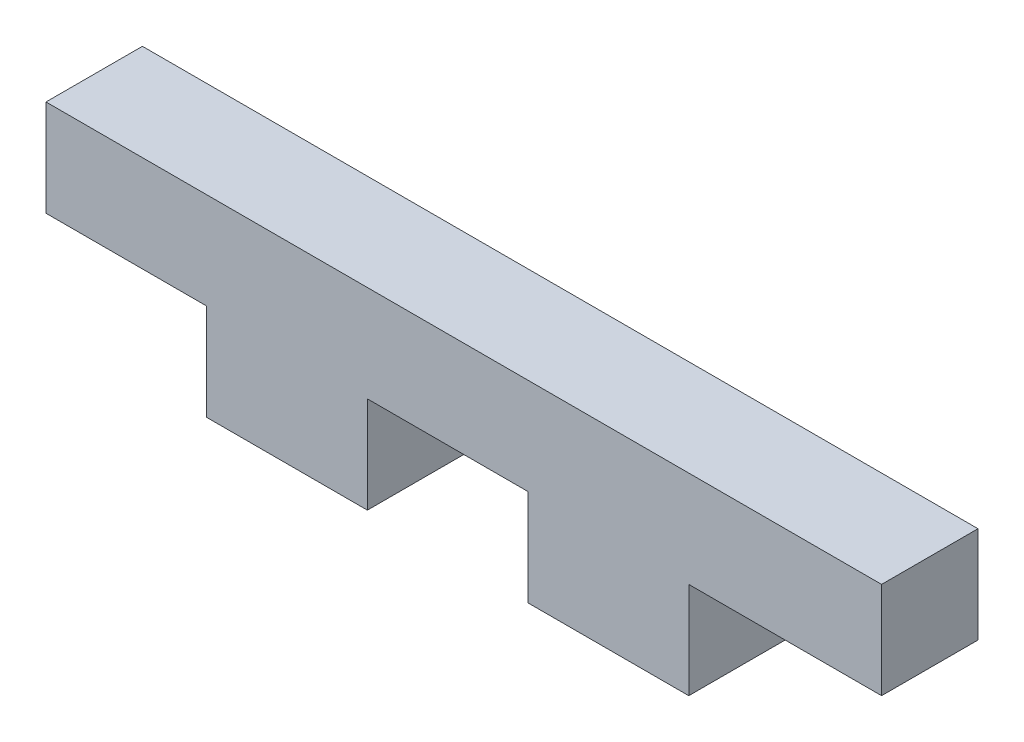
ISO-10303-21;
HEADER;
FILE_DESCRIPTION(('STEP AP214'),'2;1');
FILE_NAME('part.step','',(''),(''),'','','');
FILE_SCHEMA(('AUTOMOTIVE_DESIGN { 1 0 10303 214 1 1 1 1 }'));
ENDSEC;
DATA;
#1=APPLICATION_CONTEXT('core data for automotive mechanical design processes');
#2=APPLICATION_PROTOCOL_DEFINITION('international standard','automotive_design',2000,#1);
#3=PRODUCT_CONTEXT('',#1,'mechanical');
#4=PRODUCT('Part','Part','',(#3));
#5=PRODUCT_RELATED_PRODUCT_CATEGORY('part','',(#4));
#6=PRODUCT_DEFINITION_FORMATION('','',#4);
#7=PRODUCT_DEFINITION_CONTEXT('part definition',#1,'design');
#8=PRODUCT_DEFINITION('design','',#6,#7);
#9=PRODUCT_DEFINITION_SHAPE('','',#8);
#10=(LENGTH_UNIT() NAMED_UNIT(*) SI_UNIT(.MILLI.,.METRE.));
#11=(NAMED_UNIT(*) PLANE_ANGLE_UNIT() SI_UNIT($,.RADIAN.));
#12=(NAMED_UNIT(*) SI_UNIT($,.STERADIAN.) SOLID_ANGLE_UNIT());
#13=UNCERTAINTY_MEASURE_WITH_UNIT(LENGTH_MEASURE(1.E-05),#10,'distance_accuracy_value','');
#14=(GEOMETRIC_REPRESENTATION_CONTEXT(3) GLOBAL_UNCERTAINTY_ASSIGNED_CONTEXT((#13)) GLOBAL_UNIT_ASSIGNED_CONTEXT((#10,
#11,#12)) REPRESENTATION_CONTEXT('',''));
#15=CARTESIAN_POINT('',(0.,0.,0.));
#16=DIRECTION('',(0.,0.,1.));
#17=DIRECTION('',(1.,0.,0.));
#18=AXIS2_PLACEMENT_3D('',#15,#16,#17);
#19=CARTESIAN_POINT('',(8.99010664219347,0.,3.));
#20=DIRECTION('',(1.,0.,0.));
#21=DIRECTION('',(0.,1.,0.));
#22=AXIS2_PLACEMENT_3D('',#19,#20,#21);
#23=PLANE('',#22);
#24=DIRECTION('',(0.,-1.,0.));
#25=VECTOR('',#24,1.);
#26=CARTESIAN_POINT('',(8.99010664219347,0.,0.));
#27=LINE('',#26,#25);
#28=CARTESIAN_POINT('',(8.99010664219347,0.100430327009231,0.));
#29=VERTEX_POINT('',#28);
#30=CARTESIAN_POINT('',(8.99010664219347,-2.89956967299077,0.));
#31=VERTEX_POINT('',#30);
#32=EDGE_CURVE('E203',#29,#31,#27,.T.);
#33=ORIENTED_EDGE('',*,*,#32,.F.);
#34=DIRECTION('',(0.,0.,-1.));
#35=VECTOR('',#34,1.);
#36=CARTESIAN_POINT('',(8.99010664219347,0.100430327009231,3.));
#37=LINE('',#36,#35);
#38=CARTESIAN_POINT('',(8.99010664219347,0.100430327009231,3.));
#39=VERTEX_POINT('',#38);
#40=EDGE_CURVE('E11',#39,#29,#37,.T.);
#41=ORIENTED_EDGE('',*,*,#40,.F.);
#42=DIRECTION('',(0.,-1.,0.));
#43=VECTOR('',#42,1.);
#44=CARTESIAN_POINT('',(8.99010664219347,0.,3.));
#45=LINE('',#44,#43);
#46=CARTESIAN_POINT('',(8.99010664219347,-2.89956967299077,3.));
#47=VERTEX_POINT('',#46);
#48=EDGE_CURVE('E158',#39,#47,#45,.T.);
#49=ORIENTED_EDGE('',*,*,#48,.T.);
#50=DIRECTION('',(0.,0.,-1.));
#51=VECTOR('',#50,1.);
#52=CARTESIAN_POINT('',(8.99010664219347,-2.89956967299077,3.));
#53=LINE('',#52,#51);
#54=EDGE_CURVE('E97',#47,#31,#53,.T.);
#55=ORIENTED_EDGE('',*,*,#54,.T.);
#56=EDGE_LOOP('',(#33,#41,#49,#55));
#57=FACE_BOUND('',#56,.T.);
#58=ADVANCED_FACE('F35',(#57),#23,.T.);
#59=CARTESIAN_POINT('',(0.,0.10043032700923,3.));
#60=DIRECTION('',(0.,-1.,0.));
#61=DIRECTION('',(1.,0.,0.));
#62=AXIS2_PLACEMENT_3D('',#59,#60,#61);
#63=PLANE('',#62);
#64=DIRECTION('',(-1.,0.,0.));
#65=VECTOR('',#64,1.);
#66=CARTESIAN_POINT('',(0.,0.10043032700923,0.));
#67=LINE('',#66,#65);
#68=CARTESIAN_POINT('',(13.9901066421935,0.100430327009232,0.));
#69=VERTEX_POINT('',#68);
#70=EDGE_CURVE('E197',#69,#29,#67,.T.);
#71=ORIENTED_EDGE('',*,*,#70,.F.);
#72=DIRECTION('',(0.,0.,-1.));
#73=VECTOR('',#72,1.);
#74=CARTESIAN_POINT('',(13.9901066421935,0.100430327009232,3.));
#75=LINE('',#74,#73);
#76=CARTESIAN_POINT('',(13.9901066421935,0.100430327009232,3.));
#77=VERTEX_POINT('',#76);
#78=EDGE_CURVE('E43',#77,#69,#75,.T.);
#79=ORIENTED_EDGE('',*,*,#78,.F.);
#80=DIRECTION('',(-1.,0.,0.));
#81=VECTOR('',#80,1.);
#82=CARTESIAN_POINT('',(0.,0.10043032700923,3.));
#83=LINE('',#82,#81);
#84=EDGE_CURVE('E148',#77,#39,#83,.T.);
#85=ORIENTED_EDGE('',*,*,#84,.T.);
#86=ORIENTED_EDGE('',*,*,#40,.T.);
#87=EDGE_LOOP('',(#71,#79,#85,#86));
#88=FACE_BOUND('',#87,.T.);
#89=ADVANCED_FACE('F202',(#88),#63,.T.);
#90=CARTESIAN_POINT('',(13.9901066421935,0.,3.));
#91=DIRECTION('',(1.,0.,0.));
#92=DIRECTION('',(0.,0.,-1.));
#93=AXIS2_PLACEMENT_3D('',#90,#91,#92);
#94=PLANE('',#93);
#95=DIRECTION('',(0.,-1.,0.));
#96=VECTOR('',#95,1.);
#97=CARTESIAN_POINT('',(13.9901066421935,0.,0.));
#98=LINE('',#97,#96);
#99=CARTESIAN_POINT('',(13.9901066421935,-2.89956967299077,0.));
#100=VERTEX_POINT('',#99);
#101=EDGE_CURVE('E191',#69,#100,#98,.T.);
#102=ORIENTED_EDGE('',*,*,#101,.T.);
#103=DIRECTION('',(0.,0.,-1.));
#104=VECTOR('',#103,1.);
#105=CARTESIAN_POINT('',(13.9901066421935,-2.89956967299077,3.));
#106=LINE('',#105,#104);
#107=CARTESIAN_POINT('',(13.9901066421935,-2.89956967299077,3.));
#108=VERTEX_POINT('',#107);
#109=EDGE_CURVE('E184',#108,#100,#106,.T.);
#110=ORIENTED_EDGE('',*,*,#109,.F.);
#111=DIRECTION('',(0.,-1.,0.));
#112=VECTOR('',#111,1.);
#113=CARTESIAN_POINT('',(13.9901066421935,0.,3.));
#114=LINE('',#113,#112);
#115=EDGE_CURVE('E157',#77,#108,#114,.T.);
#116=ORIENTED_EDGE('',*,*,#115,.F.);
#117=ORIENTED_EDGE('',*,*,#78,.T.);
#118=EDGE_LOOP('',(#102,#110,#116,#117));
#119=FACE_BOUND('',#118,.T.);
#120=ADVANCED_FACE('F189',(#119),#94,.F.);
#121=CARTESIAN_POINT('',(0.,-2.89956967299077,3.));
#122=DIRECTION('',(0.,1.,0.));
#123=DIRECTION('',(0.,0.,1.));
#124=AXIS2_PLACEMENT_3D('',#121,#122,#123);
#125=PLANE('',#124);
#126=DIRECTION('',(1.,0.,0.));
#127=VECTOR('',#126,1.);
#128=CARTESIAN_POINT('',(0.,-2.89956967299077,0.));
#129=LINE('',#128,#127);
#130=CARTESIAN_POINT('',(18.9901066421935,-2.89956967299077,0.));
#131=VERTEX_POINT('',#130);
#132=EDGE_CURVE('E200',#100,#131,#129,.T.);
#133=ORIENTED_EDGE('',*,*,#132,.T.);
#134=DIRECTION('',(0.,0.,-1.));
#135=VECTOR('',#134,1.);
#136=CARTESIAN_POINT('',(18.9901066421935,-2.89956967299077,3.));
#137=LINE('',#136,#135);
#138=CARTESIAN_POINT('',(18.9901066421935,-2.89956967299077,3.));
#139=VERTEX_POINT('',#138);
#140=EDGE_CURVE('E182',#139,#131,#137,.T.);
#141=ORIENTED_EDGE('',*,*,#140,.F.);
#142=DIRECTION('',(1.,0.,0.));
#143=VECTOR('',#142,1.);
#144=CARTESIAN_POINT('',(0.,-2.89956967299077,3.));
#145=LINE('',#144,#143);
#146=EDGE_CURVE('E161',#108,#139,#145,.T.);
#147=ORIENTED_EDGE('',*,*,#146,.F.);
#148=ORIENTED_EDGE('',*,*,#109,.T.);
#149=EDGE_LOOP('',(#133,#141,#147,#148));
#150=FACE_BOUND('',#149,.T.);
#151=ADVANCED_FACE('F234',(#150),#125,.F.);
#152=CARTESIAN_POINT('',(18.9901066421935,0.,3.));
#153=DIRECTION('',(1.,0.,0.));
#154=DIRECTION('',(0.,0.,-1.));
#155=AXIS2_PLACEMENT_3D('',#152,#153,#154);
#156=PLANE('',#155);
#157=DIRECTION('',(0.,-1.,0.));
#158=VECTOR('',#157,1.);
#159=CARTESIAN_POINT('',(18.9901066421935,0.,0.));
#160=LINE('',#159,#158);
#161=CARTESIAN_POINT('',(18.9901066421935,0.100430327009233,0.));
#162=VERTEX_POINT('',#161);
#163=EDGE_CURVE('E210',#162,#131,#160,.T.);
#164=ORIENTED_EDGE('',*,*,#163,.F.);
#165=DIRECTION('',(0.,0.,-1.));
#166=VECTOR('',#165,1.);
#167=CARTESIAN_POINT('',(18.9901066421935,0.100430327009233,3.));
#168=LINE('',#167,#166);
#169=CARTESIAN_POINT('',(18.9901066421935,0.100430327009233,3.));
#170=VERTEX_POINT('',#169);
#171=EDGE_CURVE('E180',#170,#162,#168,.T.);
#172=ORIENTED_EDGE('',*,*,#171,.F.);
#173=DIRECTION('',(0.,-1.,0.));
#174=VECTOR('',#173,1.);
#175=CARTESIAN_POINT('',(18.9901066421935,0.,3.));
#176=LINE('',#175,#174);
#177=EDGE_CURVE('E155',#170,#139,#176,.T.);
#178=ORIENTED_EDGE('',*,*,#177,.T.);
#179=ORIENTED_EDGE('',*,*,#140,.T.);
#180=EDGE_LOOP('',(#164,#172,#178,#179));
#181=FACE_BOUND('',#180,.T.);
#182=ADVANCED_FACE('F239',(#181),#156,.T.);
#183=CARTESIAN_POINT('',(24.9901066421935,0.100430327009233,0.));
#184=VERTEX_POINT('',#183);
#185=EDGE_CURVE('E205',#184,#162,#67,.T.);
#186=ORIENTED_EDGE('',*,*,#185,.F.);
#187=DIRECTION('',(0.,0.,-1.));
#188=VECTOR('',#187,1.);
#189=CARTESIAN_POINT('',(24.9901066421935,0.100430327009233,3.));
#190=LINE('',#189,#188);
#191=CARTESIAN_POINT('',(24.9901066421935,0.100430327009233,3.));
#192=VERTEX_POINT('',#191);
#193=EDGE_CURVE('E178',#192,#184,#190,.T.);
#194=ORIENTED_EDGE('',*,*,#193,.F.);
#195=EDGE_CURVE('E147',#192,#170,#83,.T.);
#196=ORIENTED_EDGE('',*,*,#195,.T.);
#197=ORIENTED_EDGE('',*,*,#171,.T.);
#198=EDGE_LOOP('',(#186,#194,#196,#197));
#199=FACE_BOUND('',#198,.T.);
#200=ADVANCED_FACE('F230',(#199),#63,.T.);
#201=CARTESIAN_POINT('',(24.9901066421935,0.,3.));
#202=DIRECTION('',(1.,0.,0.));
#203=DIRECTION('',(0.,0.,-1.));
#204=AXIS2_PLACEMENT_3D('',#201,#202,#203);
#205=PLANE('',#204);
#206=DIRECTION('',(0.,-1.,0.));
#207=VECTOR('',#206,1.);
#208=CARTESIAN_POINT('',(24.9901066421935,0.,0.));
#209=LINE('',#208,#207);
#210=CARTESIAN_POINT('',(24.9901066421935,3.10043032700923,0.));
#211=VERTEX_POINT('',#210);
#212=EDGE_CURVE('E209',#211,#184,#209,.T.);
#213=ORIENTED_EDGE('',*,*,#212,.F.);
#214=DIRECTION('',(0.,0.,-1.));
#215=VECTOR('',#214,1.);
#216=CARTESIAN_POINT('',(24.9901066421935,3.10043032700923,3.));
#217=LINE('',#216,#215);
#218=CARTESIAN_POINT('',(24.9901066421935,3.10043032700923,3.));
#219=VERTEX_POINT('',#218);
#220=EDGE_CURVE('E176',#219,#211,#217,.T.);
#221=ORIENTED_EDGE('',*,*,#220,.F.);
#222=DIRECTION('',(0.,-1.,0.));
#223=VECTOR('',#222,1.);
#224=CARTESIAN_POINT('',(24.9901066421935,0.,3.));
#225=LINE('',#224,#223);
#226=EDGE_CURVE('E154',#219,#192,#225,.T.);
#227=ORIENTED_EDGE('',*,*,#226,.T.);
#228=ORIENTED_EDGE('',*,*,#193,.T.);
#229=EDGE_LOOP('',(#213,#221,#227,#228));
#230=FACE_BOUND('',#229,.T.);
#231=ADVANCED_FACE('F238',(#230),#205,.T.);
#232=CARTESIAN_POINT('',(0.,3.10043032700923,3.));
#233=DIRECTION('',(0.,-1.,0.));
#234=DIRECTION('',(1.,0.,0.));
#235=AXIS2_PLACEMENT_3D('',#232,#233,#234);
#236=PLANE('',#235);
#237=DIRECTION('',(-1.,0.,0.));
#238=VECTOR('',#237,1.);
#239=CARTESIAN_POINT('',(0.,3.10043032700923,0.));
#240=LINE('',#239,#238);
#241=CARTESIAN_POINT('',(-1.00989335780653,3.10043032700923,0.));
#242=VERTEX_POINT('',#241);
#243=EDGE_CURVE('E213',#211,#242,#240,.T.);
#244=ORIENTED_EDGE('',*,*,#243,.T.);
#245=DIRECTION('',(0.,0.,-1.));
#246=VECTOR('',#245,1.);
#247=CARTESIAN_POINT('',(-1.00989335780653,3.10043032700923,3.));
#248=LINE('',#247,#246);
#249=CARTESIAN_POINT('',(-1.00989335780653,3.10043032700923,3.));
#250=VERTEX_POINT('',#249);
#251=EDGE_CURVE('E173',#250,#242,#248,.T.);
#252=ORIENTED_EDGE('',*,*,#251,.F.);
#253=DIRECTION('',(-1.,0.,0.));
#254=VECTOR('',#253,1.);
#255=CARTESIAN_POINT('',(0.,3.10043032700923,3.));
#256=LINE('',#255,#254);
#257=EDGE_CURVE('E149',#219,#250,#256,.T.);
#258=ORIENTED_EDGE('',*,*,#257,.F.);
#259=ORIENTED_EDGE('',*,*,#220,.T.);
#260=EDGE_LOOP('',(#244,#252,#258,#259));
#261=FACE_BOUND('',#260,.T.);
#262=ADVANCED_FACE('F247',(#261),#236,.F.);
#263=CARTESIAN_POINT('',(-1.00989335780653,0.,3.));
#264=DIRECTION('',(1.,0.,0.));
#265=DIRECTION('',(0.,1.,0.));
#266=AXIS2_PLACEMENT_3D('',#263,#264,#265);
#267=PLANE('',#266);
#268=DIRECTION('',(0.,-1.,0.));
#269=VECTOR('',#268,1.);
#270=CARTESIAN_POINT('',(-1.00989335780653,0.,0.));
#271=LINE('',#270,#269);
#272=CARTESIAN_POINT('',(-1.00989335780653,0.10043032700923,0.));
#273=VERTEX_POINT('',#272);
#274=EDGE_CURVE('E207',#242,#273,#271,.T.);
#275=ORIENTED_EDGE('',*,*,#274,.T.);
#276=DIRECTION('',(0.,0.,-1.));
#277=VECTOR('',#276,1.);
#278=CARTESIAN_POINT('',(-1.00989335780653,0.10043032700923,3.));
#279=LINE('',#278,#277);
#280=CARTESIAN_POINT('',(-1.00989335780653,0.10043032700923,3.));
#281=VERTEX_POINT('',#280);
#282=EDGE_CURVE('E136',#281,#273,#279,.T.);
#283=ORIENTED_EDGE('',*,*,#282,.F.);
#284=DIRECTION('',(0.,-1.,0.));
#285=VECTOR('',#284,1.);
#286=CARTESIAN_POINT('',(-1.00989335780653,0.,3.));
#287=LINE('',#286,#285);
#288=EDGE_CURVE('E144',#250,#281,#287,.T.);
#289=ORIENTED_EDGE('',*,*,#288,.F.);
#290=ORIENTED_EDGE('',*,*,#251,.T.);
#291=EDGE_LOOP('',(#275,#283,#289,#290));
#292=FACE_BOUND('',#291,.T.);
#293=ADVANCED_FACE('F222',(#292),#267,.F.);
#294=CARTESIAN_POINT('',(3.99010664219347,0.100430327009231,0.));
#295=VERTEX_POINT('',#294);
#296=EDGE_CURVE('E135',#295,#273,#67,.T.);
#297=ORIENTED_EDGE('',*,*,#296,.F.);
#298=DIRECTION('',(0.,0.,-1.));
#299=VECTOR('',#298,1.);
#300=CARTESIAN_POINT('',(3.99010664219347,0.100430327009231,3.));
#301=LINE('',#300,#299);
#302=CARTESIAN_POINT('',(3.99010664219347,0.100430327009231,3.));
#303=VERTEX_POINT('',#302);
#304=EDGE_CURVE('E129',#303,#295,#301,.T.);
#305=ORIENTED_EDGE('',*,*,#304,.F.);
#306=EDGE_CURVE('E133',#303,#281,#83,.T.);
#307=ORIENTED_EDGE('',*,*,#306,.T.);
#308=ORIENTED_EDGE('',*,*,#282,.T.);
#309=EDGE_LOOP('',(#297,#305,#307,#308));
#310=FACE_BOUND('',#309,.T.);
#311=ADVANCED_FACE('F131',(#310),#63,.T.);
#312=CARTESIAN_POINT('',(3.99010664219347,0.,3.));
#313=DIRECTION('',(1.,0.,0.));
#314=DIRECTION('',(0.,1.,0.));
#315=AXIS2_PLACEMENT_3D('',#312,#313,#314);
#316=PLANE('',#315);
#317=DIRECTION('',(0.,-1.,0.));
#318=VECTOR('',#317,1.);
#319=CARTESIAN_POINT('',(3.99010664219347,0.,0.));
#320=LINE('',#319,#318);
#321=CARTESIAN_POINT('',(3.99010664219347,-2.89956967299077,0.));
#322=VERTEX_POINT('',#321);
#323=EDGE_CURVE('E90',#295,#322,#320,.T.);
#324=ORIENTED_EDGE('',*,*,#323,.T.);
#325=DIRECTION('',(0.,0.,-1.));
#326=VECTOR('',#325,1.);
#327=CARTESIAN_POINT('',(3.99010664219347,-2.89956967299077,3.));
#328=LINE('',#327,#326);
#329=CARTESIAN_POINT('',(3.99010664219347,-2.89956967299077,3.));
#330=VERTEX_POINT('',#329);
#331=EDGE_CURVE('E137',#330,#322,#328,.T.);
#332=ORIENTED_EDGE('',*,*,#331,.F.);
#333=DIRECTION('',(0.,-1.,0.));
#334=VECTOR('',#333,1.);
#335=CARTESIAN_POINT('',(3.99010664219347,0.,3.));
#336=LINE('',#335,#334);
#337=EDGE_CURVE('E139',#303,#330,#336,.T.);
#338=ORIENTED_EDGE('',*,*,#337,.F.);
#339=ORIENTED_EDGE('',*,*,#304,.T.);
#340=EDGE_LOOP('',(#324,#332,#338,#339));
#341=FACE_BOUND('',#340,.T.);
#342=ADVANCED_FACE('F140',(#341),#316,.F.);
#343=CARTESIAN_POINT('',(0.,-2.89956967299077,3.));
#344=DIRECTION('',(0.,1.,0.));
#345=DIRECTION('',(-1.,0.,0.));
#346=AXIS2_PLACEMENT_3D('',#343,#344,#345);
#347=PLANE('',#346);
#348=DIRECTION('',(1.,0.,0.));
#349=VECTOR('',#348,1.);
#350=CARTESIAN_POINT('',(0.,-2.89956967299077,0.));
#351=LINE('',#350,#349);
#352=EDGE_CURVE('E162',#322,#31,#351,.T.);
#353=ORIENTED_EDGE('',*,*,#352,.T.);
#354=ORIENTED_EDGE('',*,*,#54,.F.);
#355=DIRECTION('',(1.,0.,0.));
#356=VECTOR('',#355,1.);
#357=CARTESIAN_POINT('',(0.,-2.89956967299077,3.));
#358=LINE('',#357,#356);
#359=EDGE_CURVE('E51',#330,#47,#358,.T.);
#360=ORIENTED_EDGE('',*,*,#359,.F.);
#361=ORIENTED_EDGE('',*,*,#331,.T.);
#362=EDGE_LOOP('',(#353,#354,#360,#361));
#363=FACE_BOUND('',#362,.T.);
#364=ADVANCED_FACE('F246',(#363),#347,.F.);
#365=CARTESIAN_POINT('',(0.,0.,3.));
#366=DIRECTION('',(0.,0.,1.));
#367=DIRECTION('',(1.,0.,0.));
#368=AXIS2_PLACEMENT_3D('',#365,#366,#367);
#369=PLANE('',#368);
#370=ORIENTED_EDGE('',*,*,#48,.F.);
#371=ORIENTED_EDGE('',*,*,#84,.F.);
#372=ORIENTED_EDGE('',*,*,#115,.T.);
#373=ORIENTED_EDGE('',*,*,#146,.T.);
#374=ORIENTED_EDGE('',*,*,#177,.F.);
#375=ORIENTED_EDGE('',*,*,#195,.F.);
#376=ORIENTED_EDGE('',*,*,#226,.F.);
#377=ORIENTED_EDGE('',*,*,#257,.T.);
#378=ORIENTED_EDGE('',*,*,#288,.T.);
#379=ORIENTED_EDGE('',*,*,#306,.F.);
#380=ORIENTED_EDGE('',*,*,#337,.T.);
#381=ORIENTED_EDGE('',*,*,#359,.T.);
#382=EDGE_LOOP('',(#370,#371,#372,#373,#374,#375,#376,#377,#378,#379,#380,#381));
#383=FACE_BOUND('',#382,.T.);
#384=ADVANCED_FACE('F142',(#383),#369,.T.);
#385=CARTESIAN_POINT('',(0.,0.,0.));
#386=DIRECTION('',(0.,0.,1.));
#387=DIRECTION('',(1.,0.,0.));
#388=AXIS2_PLACEMENT_3D('',#385,#386,#387);
#389=PLANE('',#388);
#390=ORIENTED_EDGE('',*,*,#32,.T.);
#391=ORIENTED_EDGE('',*,*,#352,.F.);
#392=ORIENTED_EDGE('',*,*,#323,.F.);
#393=ORIENTED_EDGE('',*,*,#296,.T.);
#394=ORIENTED_EDGE('',*,*,#274,.F.);
#395=ORIENTED_EDGE('',*,*,#243,.F.);
#396=ORIENTED_EDGE('',*,*,#212,.T.);
#397=ORIENTED_EDGE('',*,*,#185,.T.);
#398=ORIENTED_EDGE('',*,*,#163,.T.);
#399=ORIENTED_EDGE('',*,*,#132,.F.);
#400=ORIENTED_EDGE('',*,*,#101,.F.);
#401=ORIENTED_EDGE('',*,*,#70,.T.);
#402=EDGE_LOOP('',(#390,#391,#392,#393,#394,#395,#396,#397,#398,#399,#400,#401));
#403=FACE_BOUND('',#402,.T.);
#404=ADVANCED_FACE('F196',(#403),#389,.F.);
#405=CLOSED_SHELL('',(#58,#89,#120,#151,#182,#200,#231,#262,#293,#311,#342,#364,#384,#404));
#406=MANIFOLD_SOLID_BREP('B2',#405);
#407=ADVANCED_BREP_SHAPE_REPRESENTATION('',(#18,#406),#14);
#408=SHAPE_DEFINITION_REPRESENTATION(#9,#407);
ENDSEC;
END-ISO-10303-21;
